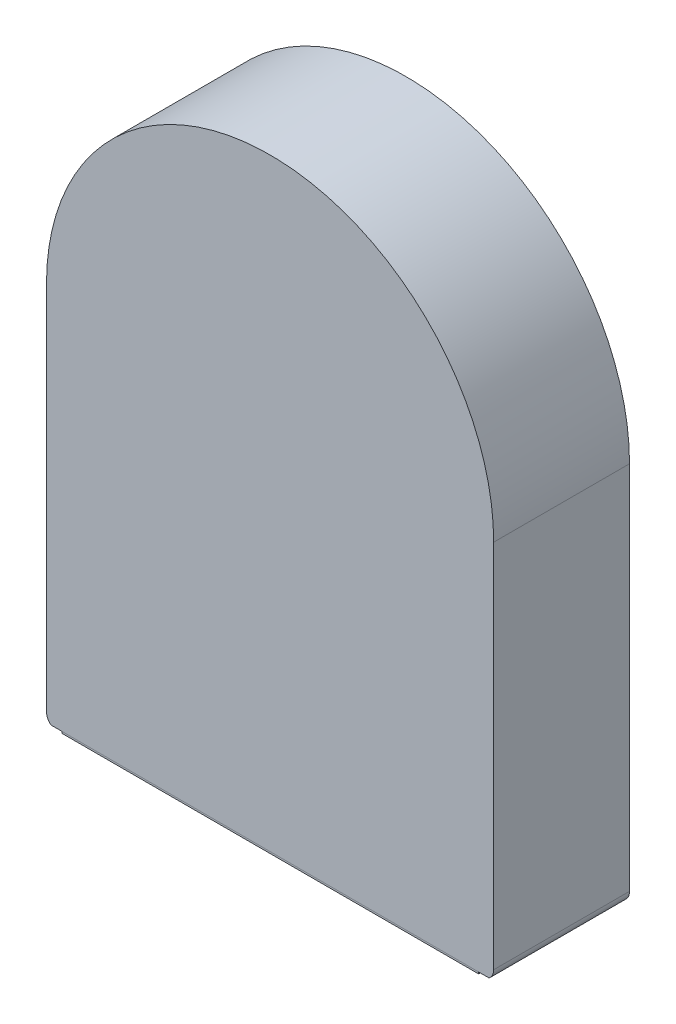
ISO-10303-21;
HEADER;
FILE_DESCRIPTION(('STEP AP214'),'2;1');
FILE_NAME('part.step','',(''),(''),'','','');
FILE_SCHEMA(('AUTOMOTIVE_DESIGN { 1 0 10303 214 1 1 1 1 }'));
ENDSEC;
DATA;
#1=APPLICATION_CONTEXT('core data for automotive mechanical design processes');
#2=APPLICATION_PROTOCOL_DEFINITION('international standard','automotive_design',2000,#1);
#3=PRODUCT_CONTEXT('',#1,'mechanical');
#4=PRODUCT('Part','Part','',(#3));
#5=PRODUCT_RELATED_PRODUCT_CATEGORY('part','',(#4));
#6=PRODUCT_DEFINITION_FORMATION('','',#4);
#7=PRODUCT_DEFINITION_CONTEXT('part definition',#1,'design');
#8=PRODUCT_DEFINITION('design','',#6,#7);
#9=PRODUCT_DEFINITION_SHAPE('','',#8);
#10=(LENGTH_UNIT() NAMED_UNIT(*) SI_UNIT(.MILLI.,.METRE.));
#11=(NAMED_UNIT(*) PLANE_ANGLE_UNIT() SI_UNIT($,.RADIAN.));
#12=(NAMED_UNIT(*) SI_UNIT($,.STERADIAN.) SOLID_ANGLE_UNIT());
#13=UNCERTAINTY_MEASURE_WITH_UNIT(LENGTH_MEASURE(1.E-05),#10,'distance_accuracy_value','');
#14=(GEOMETRIC_REPRESENTATION_CONTEXT(3) GLOBAL_UNCERTAINTY_ASSIGNED_CONTEXT((#13)) GLOBAL_UNIT_ASSIGNED_CONTEXT((#10,
#11,#12)) REPRESENTATION_CONTEXT('',''));
#15=CARTESIAN_POINT('',(0.,0.,0.));
#16=DIRECTION('',(0.,0.,1.));
#17=DIRECTION('',(1.,0.,0.));
#18=AXIS2_PLACEMENT_3D('',#15,#16,#17);
#19=CARTESIAN_POINT('',(8.8,-15.4,5.65));
#20=DIRECTION('',(0.,0.,-1.));
#21=DIRECTION('',(-1.,0.,0.));
#22=AXIS2_PLACEMENT_3D('',#19,#20,#21);
#23=CYLINDRICAL_SURFACE('',#22,0.5);
#24=CARTESIAN_POINT('',(8.8,-15.4,6.03039935251033));
#25=DIRECTION('',(0.,0.713250449154018,-0.700909264300018));
#26=DIRECTION('',(0.,0.700909264300018,0.713250449154018));
#27=AXIS2_PLACEMENT_3D('',#24,#25,#26);
#28=ELLIPSE('',#27,0.713359097199747,0.5);
#29=CARTESIAN_POINT('',(9.10934525688194,-15.79281740293,5.63066545920087));
#30=VERTEX_POINT('',#29);
#31=CARTESIAN_POINT('',(8.8,-15.9,5.52159565602451));
#32=VERTEX_POINT('',#31);
#33=EDGE_CURVE('E53',#30,#32,#28,.T.);
#34=ORIENTED_EDGE('',*,*,#33,.T.);
#35=DIRECTION('',(0.,0.,-1.));
#36=VECTOR('',#35,1.);
#37=CARTESIAN_POINT('',(8.8,-15.9,5.65));
#38=LINE('',#37,#36);
#39=CARTESIAN_POINT('',(8.8,-15.9,0.));
#40=VERTEX_POINT('',#39);
#41=EDGE_CURVE('E255',#40,#32,#38,.F.);
#42=ORIENTED_EDGE('',*,*,#41,.F.);
#43=CARTESIAN_POINT('',(8.8,-15.4,0.));
#44=DIRECTION('',(0.,0.,1.));
#45=DIRECTION('',(1.,0.,0.));
#46=AXIS2_PLACEMENT_3D('',#43,#44,#45);
#47=CIRCLE('',#46,0.5);
#48=CARTESIAN_POINT('',(9.3,-15.4,0.));
#49=VERTEX_POINT('',#48);
#50=EDGE_CURVE('E259',#49,#40,#47,.F.);
#51=ORIENTED_EDGE('',*,*,#50,.F.);
#52=DIRECTION('',(0.,0.,-1.));
#53=VECTOR('',#52,1.);
#54=CARTESIAN_POINT('',(9.3,-15.4,5.65));
#55=LINE('',#54,#53);
#56=CARTESIAN_POINT('',(9.3,-15.4,5.65));
#57=VERTEX_POINT('',#56);
#58=EDGE_CURVE('E263',#57,#49,#55,.T.);
#59=ORIENTED_EDGE('',*,*,#58,.F.);
#60=CARTESIAN_POINT('',(8.8,-15.4,5.65));
#61=DIRECTION('',(0.,0.,1.));
#62=DIRECTION('',(1.,0.,0.));
#63=AXIS2_PLACEMENT_3D('',#60,#61,#62);
#64=CIRCLE('',#63,0.5);
#65=CARTESIAN_POINT('',(9.10934525688194,-15.79281740293,5.65));
#66=VERTEX_POINT('',#65);
#67=EDGE_CURVE('E250',#66,#57,#64,.T.);
#68=ORIENTED_EDGE('',*,*,#67,.F.);
#69=DIRECTION('',(0.,0.,-1.));
#70=VECTOR('',#69,1.);
#71=CARTESIAN_POINT('',(9.10934525730095,-15.7928174026,5.65));
#72=LINE('',#71,#70);
#73=EDGE_CURVE('E46',#30,#66,#72,.F.);
#74=ORIENTED_EDGE('',*,*,#73,.F.);
#75=EDGE_LOOP('',(#34,#42,#51,#59,#68,#74));
#76=FACE_BOUND('',#75,.T.);
#77=ADVANCED_FACE('F36',(#76),#23,.T.);
#78=CARTESIAN_POINT('',(-8.8,-15.4,5.65));
#79=DIRECTION('',(0.,0.,-1.));
#80=DIRECTION('',(-1.,0.,0.));
#81=AXIS2_PLACEMENT_3D('',#78,#79,#80);
#82=CYLINDRICAL_SURFACE('',#81,0.5);
#83=CARTESIAN_POINT('',(-8.8,-15.4,5.65));
#84=DIRECTION('',(0.,0.,1.));
#85=DIRECTION('',(1.,0.,0.));
#86=AXIS2_PLACEMENT_3D('',#83,#84,#85);
#87=CIRCLE('',#86,0.5);
#88=CARTESIAN_POINT('',(-9.3,-15.4,5.65));
#89=VERTEX_POINT('',#88);
#90=CARTESIAN_POINT('',(-9.10934525730095,-15.7928174026,5.65));
#91=VERTEX_POINT('',#90);
#92=EDGE_CURVE('E252',#89,#91,#87,.T.);
#93=ORIENTED_EDGE('',*,*,#92,.F.);
#94=DIRECTION('',(0.,0.,-1.));
#95=VECTOR('',#94,1.);
#96=CARTESIAN_POINT('',(-9.3,-15.4,5.65));
#97=LINE('',#96,#95);
#98=CARTESIAN_POINT('',(-9.3,-15.4,0.));
#99=VERTEX_POINT('',#98);
#100=EDGE_CURVE('E248',#99,#89,#97,.F.);
#101=ORIENTED_EDGE('',*,*,#100,.F.);
#102=CARTESIAN_POINT('',(-8.8,-15.4,0.));
#103=DIRECTION('',(0.,0.,1.));
#104=DIRECTION('',(1.,0.,0.));
#105=AXIS2_PLACEMENT_3D('',#102,#103,#104);
#106=CIRCLE('',#105,0.5);
#107=CARTESIAN_POINT('',(-8.8,-15.9,0.));
#108=VERTEX_POINT('',#107);
#109=EDGE_CURVE('E261',#108,#99,#106,.F.);
#110=ORIENTED_EDGE('',*,*,#109,.F.);
#111=DIRECTION('',(0.,0.,-1.));
#112=VECTOR('',#111,1.);
#113=CARTESIAN_POINT('',(-8.8,-15.9,5.65));
#114=LINE('',#113,#112);
#115=CARTESIAN_POINT('',(-8.8,-15.9,5.52159565602451));
#116=VERTEX_POINT('',#115);
#117=EDGE_CURVE('E257',#116,#108,#114,.T.);
#118=ORIENTED_EDGE('',*,*,#117,.F.);
#119=CARTESIAN_POINT('',(-8.8,-15.4,6.03039935251033));
#120=DIRECTION('',(0.,0.713250449154018,-0.700909264300018));
#121=DIRECTION('',(0.,0.700909264300018,0.713250449154018));
#122=AXIS2_PLACEMENT_3D('',#119,#120,#121);
#123=ELLIPSE('',#122,0.713359097199747,0.5);
#124=CARTESIAN_POINT('',(-9.10934525730095,-15.7928174026,5.63066545953665));
#125=VERTEX_POINT('',#124);
#126=EDGE_CURVE('E143',#116,#125,#123,.T.);
#127=ORIENTED_EDGE('',*,*,#126,.T.);
#128=DIRECTION('',(0.,0.,1.));
#129=VECTOR('',#128,1.);
#130=CARTESIAN_POINT('',(-9.10934525730095,-15.7928174026,5.63066545953665));
#131=LINE('',#130,#129);
#132=EDGE_CURVE('E193',#125,#91,#131,.T.);
#133=ORIENTED_EDGE('',*,*,#132,.T.);
#134=EDGE_LOOP('',(#93,#101,#110,#118,#127,#133));
#135=FACE_BOUND('',#134,.T.);
#136=ADVANCED_FACE('F38',(#135),#82,.T.);
#137=CARTESIAN_POINT('',(0.,0.,5.65));
#138=DIRECTION('',(0.,0.,-1.));
#139=DIRECTION('',(-1.,0.,0.));
#140=AXIS2_PLACEMENT_3D('',#137,#138,#139);
#141=CYLINDRICAL_SURFACE('',#140,9.3);
#142=CARTESIAN_POINT('',(0.,0.,0.));
#143=DIRECTION('',(0.,0.,1.));
#144=DIRECTION('',(1.,0.,0.));
#145=AXIS2_PLACEMENT_3D('',#142,#143,#144);
#146=CIRCLE('',#145,9.3);
#147=CARTESIAN_POINT('',(9.3,0.,0.));
#148=VERTEX_POINT('',#147);
#149=CARTESIAN_POINT('',(-9.3,0.,0.));
#150=VERTEX_POINT('',#149);
#151=EDGE_CURVE('E198',#148,#150,#146,.T.);
#152=ORIENTED_EDGE('',*,*,#151,.T.);
#153=DIRECTION('',(0.,0.,-1.));
#154=VECTOR('',#153,1.);
#155=CARTESIAN_POINT('',(-9.3,0.,5.65));
#156=LINE('',#155,#154);
#157=CARTESIAN_POINT('',(-9.3,0.,5.65));
#158=VERTEX_POINT('',#157);
#159=EDGE_CURVE('E265',#158,#150,#156,.T.);
#160=ORIENTED_EDGE('',*,*,#159,.F.);
#161=CARTESIAN_POINT('',(0.,0.,5.65));
#162=DIRECTION('',(0.,0.,1.));
#163=DIRECTION('',(1.,0.,0.));
#164=AXIS2_PLACEMENT_3D('',#161,#162,#163);
#165=CIRCLE('',#164,9.3);
#166=CARTESIAN_POINT('',(9.3,0.,5.65));
#167=VERTEX_POINT('',#166);
#168=EDGE_CURVE('E242',#167,#158,#165,.T.);
#169=ORIENTED_EDGE('',*,*,#168,.F.);
#170=DIRECTION('',(0.,0.,-1.));
#171=VECTOR('',#170,1.);
#172=CARTESIAN_POINT('',(9.3,0.,5.65));
#173=LINE('',#172,#171);
#174=EDGE_CURVE('E267',#167,#148,#173,.T.);
#175=ORIENTED_EDGE('',*,*,#174,.T.);
#176=EDGE_LOOP('',(#152,#160,#169,#175));
#177=FACE_BOUND('',#176,.T.);
#178=ADVANCED_FACE('F355',(#177),#141,.T.);
#179=CARTESIAN_POINT('',(-9.3,0.,5.65));
#180=DIRECTION('',(1.,0.,0.));
#181=DIRECTION('',(0.,1.,0.));
#182=AXIS2_PLACEMENT_3D('',#179,#180,#181);
#183=PLANE('',#182);
#184=ORIENTED_EDGE('',*,*,#159,.T.);
#185=DIRECTION('',(0.,-1.,0.));
#186=VECTOR('',#185,1.);
#187=CARTESIAN_POINT('',(-9.3,0.,0.));
#188=LINE('',#187,#186);
#189=EDGE_CURVE('E275',#150,#99,#188,.T.);
#190=ORIENTED_EDGE('',*,*,#189,.T.);
#191=ORIENTED_EDGE('',*,*,#100,.T.);
#192=DIRECTION('',(0.,-1.,0.));
#193=VECTOR('',#192,1.);
#194=CARTESIAN_POINT('',(-9.3,0.,5.65));
#195=LINE('',#194,#193);
#196=EDGE_CURVE('E239',#158,#89,#195,.T.);
#197=ORIENTED_EDGE('',*,*,#196,.F.);
#198=EDGE_LOOP('',(#184,#190,#191,#197));
#199=FACE_BOUND('',#198,.T.);
#200=ADVANCED_FACE('F356',(#199),#183,.F.);
#201=CARTESIAN_POINT('',(-9.3,-15.9,5.65));
#202=DIRECTION('',(0.,1.,0.));
#203=DIRECTION('',(0.,0.,1.));
#204=AXIS2_PLACEMENT_3D('',#201,#202,#203);
#205=PLANE('',#204);
#206=ORIENTED_EDGE('',*,*,#41,.T.);
#207=DIRECTION('',(-1.,0.,0.));
#208=VECTOR('',#207,1.);
#209=CARTESIAN_POINT('',(0.,-15.9,5.52159565602451));
#210=LINE('',#209,#208);
#211=EDGE_CURVE('E335',#32,#116,#210,.T.);
#212=ORIENTED_EDGE('',*,*,#211,.T.);
#213=ORIENTED_EDGE('',*,*,#117,.T.);
#214=DIRECTION('',(1.,0.,0.));
#215=VECTOR('',#214,1.);
#216=CARTESIAN_POINT('',(-9.3,-15.9,0.));
#217=LINE('',#216,#215);
#218=EDGE_CURVE('E272',#108,#40,#217,.T.);
#219=ORIENTED_EDGE('',*,*,#218,.T.);
#220=EDGE_LOOP('',(#206,#212,#213,#219));
#221=FACE_BOUND('',#220,.T.);
#222=ADVANCED_FACE('F341',(#221),#205,.F.);
#223=CARTESIAN_POINT('',(9.3,0.,5.65));
#224=DIRECTION('',(-1.,0.,0.));
#225=DIRECTION('',(0.,-1.,0.));
#226=AXIS2_PLACEMENT_3D('',#223,#224,#225);
#227=PLANE('',#226);
#228=ORIENTED_EDGE('',*,*,#58,.T.);
#229=DIRECTION('',(0.,1.,0.));
#230=VECTOR('',#229,1.);
#231=CARTESIAN_POINT('',(9.3,0.,0.));
#232=LINE('',#231,#230);
#233=EDGE_CURVE('E245',#49,#148,#232,.T.);
#234=ORIENTED_EDGE('',*,*,#233,.T.);
#235=ORIENTED_EDGE('',*,*,#174,.F.);
#236=DIRECTION('',(0.,1.,0.));
#237=VECTOR('',#236,1.);
#238=CARTESIAN_POINT('',(9.3,0.,5.65));
#239=LINE('',#238,#237);
#240=EDGE_CURVE('E269',#57,#167,#239,.T.);
#241=ORIENTED_EDGE('',*,*,#240,.F.);
#242=EDGE_LOOP('',(#228,#234,#235,#241));
#243=FACE_BOUND('',#242,.T.);
#244=ADVANCED_FACE('F352',(#243),#227,.F.);
#245=CARTESIAN_POINT('',(0.,0.,5.65));
#246=DIRECTION('',(0.,0.,1.));
#247=DIRECTION('',(1.,0.,0.));
#248=AXIS2_PLACEMENT_3D('',#245,#246,#247);
#249=PLANE('',#248);
#250=DIRECTION('',(1.,0.,0.));
#251=VECTOR('',#250,1.);
#252=CARTESIAN_POINT('',(-5.00000000075,-15.7926514013,5.64999710245));
#253=LINE('',#252,#251);
#254=CARTESIAN_POINT('',(-6.97971042440521,-15.7927344019421,5.64999855122482));
#255=VERTEX_POINT('',#254);
#256=CARTESIAN_POINT('',(2.97381740255382,-15.7926513759911,5.64999855122139));
#257=VERTEX_POINT('',#256);
#258=EDGE_CURVE('E174',#255,#257,#253,.T.);
#259=ORIENTED_EDGE('',*,*,#258,.T.);
#260=DIRECTION('',(0.999999999999744,1.24820653344968E-08,7.15097058320817E-07));
#261=VECTOR('',#260,1.);
#262=CARTESIAN_POINT('',(4.99999999925,-15.792651376,5.64999855136));
#263=LINE('',#262,#261);
#264=CARTESIAN_POINT('',(6.97971041935568,-15.7927343769389,5.64999998352249));
#265=VERTEX_POINT('',#264);
#266=EDGE_CURVE('E177',#257,#265,#263,.T.);
#267=ORIENTED_EDGE('',*,*,#266,.T.);
#268=DIRECTION('',(-1.,0.,0.));
#269=VECTOR('',#268,1.);
#270=CARTESIAN_POINT('',(0.,-15.7928174026,5.65));
#271=LINE('',#270,#269);
#272=EDGE_CURVE('E196',#66,#265,#271,.T.);
#273=ORIENTED_EDGE('',*,*,#272,.F.);
#274=ORIENTED_EDGE('',*,*,#67,.T.);
#275=ORIENTED_EDGE('',*,*,#240,.T.);
#276=ORIENTED_EDGE('',*,*,#168,.T.);
#277=ORIENTED_EDGE('',*,*,#196,.T.);
#278=ORIENTED_EDGE('',*,*,#92,.T.);
#279=DIRECTION('',(-1.,0.,0.));
#280=VECTOR('',#279,1.);
#281=CARTESIAN_POINT('',(0.,-15.7928174026,5.65));
#282=LINE('',#281,#280);
#283=EDGE_CURVE('E11',#255,#91,#282,.T.);
#284=ORIENTED_EDGE('',*,*,#283,.F.);
#285=EDGE_LOOP('',(#259,#267,#273,#274,#275,#276,#277,#278,#284));
#286=FACE_BOUND('',#285,.T.);
#287=ADVANCED_FACE('F285',(#286),#249,.T.);
#288=CARTESIAN_POINT('',(0.,0.,0.));
#289=DIRECTION('',(0.,0.,1.));
#290=DIRECTION('',(1.,0.,0.));
#291=AXIS2_PLACEMENT_3D('',#288,#289,#290);
#292=PLANE('',#291);
#293=ORIENTED_EDGE('',*,*,#233,.F.);
#294=ORIENTED_EDGE('',*,*,#50,.T.);
#295=ORIENTED_EDGE('',*,*,#218,.F.);
#296=ORIENTED_EDGE('',*,*,#109,.T.);
#297=ORIENTED_EDGE('',*,*,#189,.F.);
#298=ORIENTED_EDGE('',*,*,#151,.F.);
#299=EDGE_LOOP('',(#293,#294,#295,#296,#297,#298));
#300=FACE_BOUND('',#299,.T.);
#301=ADVANCED_FACE('F218',(#300),#292,.F.);
#302=CARTESIAN_POINT('',(-10.,-15.7928174026,7.15));
#303=DIRECTION('',(0.,1.,0.));
#304=DIRECTION('',(0.,0.,1.));
#305=AXIS2_PLACEMENT_3D('',#302,#303,#304);
#306=PLANE('',#305);
#307=ORIENTED_EDGE('',*,*,#272,.T.);
#308=CARTESIAN_POINT('',(6.97975192830906,-15.7928174026,5.64048689252252));
#309=DIRECTION('',(-0.00436264473487639,0.0174522403538263,0.999838180225955));
#310=VECTOR('',#309,1.);
#311=LINE('',#308,#310);
#312=CARTESIAN_POINT('',(6.97975192830905,-15.7928174026,5.64048689252252));
#313=VERTEX_POINT('',#312);
#314=EDGE_CURVE('E185',#313,#265,#311,.T.);
#315=ORIENTED_EDGE('',*,*,#314,.F.);
#316=DIRECTION('',(1.,0.,0.));
#317=VECTOR('',#316,1.);
#318=CARTESIAN_POINT('',(-8.66700053469144,-15.7928174026,5.64048689252252));
#319=LINE('',#318,#317);
#320=CARTESIAN_POINT('',(8.66820089689577,-15.7928174026,5.64048689252252));
#321=VERTEX_POINT('',#320);
#322=EDGE_CURVE('E158',#313,#321,#319,.T.);
#323=ORIENTED_EDGE('',*,*,#322,.T.);
#324=DIRECTION('',(0.,0.,-1.));
#325=VECTOR('',#324,1.);
#326=CARTESIAN_POINT('',(8.66820089689577,-15.7928174026,0.999999999999998));
#327=LINE('',#326,#325);
#328=CARTESIAN_POINT('',(8.66821322781486,-15.7928174036935,5.63066545842397));
#329=VERTEX_POINT('',#328);
#330=EDGE_CURVE('E150',#321,#329,#327,.T.);
#331=ORIENTED_EDGE('',*,*,#330,.T.);
#332=DIRECTION('',(-1.,-1.73074002985439E-09,-1.7612138496918E-09));
#333=VECTOR('',#332,1.);
#334=CARTESIAN_POINT('',(-4.9999999983754,-15.7928174273496,5.6306654343513));
#335=LINE('',#334,#333);
#336=EDGE_CURVE('E134',#30,#329,#335,.T.);
#337=ORIENTED_EDGE('',*,*,#336,.F.);
#338=ORIENTED_EDGE('',*,*,#73,.T.);
#339=EDGE_LOOP('',(#307,#315,#323,#331,#337,#338));
#340=FACE_BOUND('',#339,.T.);
#341=ADVANCED_FACE('F155',(#340),#306,.F.);
#342=CARTESIAN_POINT('',(8.27396970801,-15.8738174032,0.999999999999998));
#343=DIRECTION('',(0.,-1.,0.));
#344=DIRECTION('',(0.,0.,-1.));
#345=AXIS2_PLACEMENT_3D('',#342,#343,#344);
#346=PLANE('',#345);
#347=DIRECTION('',(1.,0.,0.));
#348=VECTOR('',#347,1.);
#349=CARTESIAN_POINT('',(8.27396970801,-15.8738174032,5.54823926009538));
#350=LINE('',#349,#348);
#351=CARTESIAN_POINT('',(-8.66700053469144,-15.8738174032,5.54823926009538));
#352=VERTEX_POINT('',#351);
#353=CARTESIAN_POINT('',(8.66820089689577,-15.8738174032,5.54823926009538));
#354=VERTEX_POINT('',#353);
#355=EDGE_CURVE('E153',#352,#354,#350,.T.);
#356=ORIENTED_EDGE('',*,*,#355,.T.);
#357=DIRECTION('',(0.,0.,-1.));
#358=VECTOR('',#357,1.);
#359=CARTESIAN_POINT('',(8.66820089689577,-15.8738174032,0.999999999999998));
#360=LINE('',#359,#358);
#361=CARTESIAN_POINT('',(8.66820089689577,-15.8738174032,5.64048689252252));
#362=VERTEX_POINT('',#361);
#363=EDGE_CURVE('E151',#362,#354,#360,.T.);
#364=ORIENTED_EDGE('',*,*,#363,.F.);
#365=DIRECTION('',(1.,0.,0.));
#366=VECTOR('',#365,1.);
#367=CARTESIAN_POINT('',(-8.66700053469144,-15.8738174032,5.64048689252252));
#368=LINE('',#367,#366);
#369=CARTESIAN_POINT('',(-8.66700053469144,-15.8738174032,5.64048689252252));
#370=VERTEX_POINT('',#369);
#371=EDGE_CURVE('E160',#370,#362,#368,.T.);
#372=ORIENTED_EDGE('',*,*,#371,.F.);
#373=DIRECTION('',(0.,0.,1.));
#374=VECTOR('',#373,1.);
#375=CARTESIAN_POINT('',(-8.66700053469144,-15.8738174032,0.999999999999998));
#376=LINE('',#375,#374);
#377=EDGE_CURVE('E319',#352,#370,#376,.T.);
#378=ORIENTED_EDGE('',*,*,#377,.F.);
#379=EDGE_LOOP('',(#356,#364,#372,#378));
#380=FACE_BOUND('',#379,.T.);
#381=ADVANCED_FACE('F217',(#380),#346,.T.);
#382=ORIENTED_EDGE('',*,*,#283,.T.);
#383=ORIENTED_EDGE('',*,*,#132,.F.);
#384=DIRECTION('',(-1.,0.,0.));
#385=VECTOR('',#384,1.);
#386=CARTESIAN_POINT('',(-10.,-15.7928174026,5.63066545953665));
#387=LINE('',#386,#385);
#388=CARTESIAN_POINT('',(-8.66700053469144,-15.7928174026,5.63066545953665));
#389=VERTEX_POINT('',#388);
#390=EDGE_CURVE('E295',#389,#125,#387,.T.);
#391=ORIENTED_EDGE('',*,*,#390,.F.);
#392=DIRECTION('',(0.,0.,1.));
#393=VECTOR('',#392,1.);
#394=CARTESIAN_POINT('',(-8.66700053469144,-15.7928174026,0.999999999999998));
#395=LINE('',#394,#393);
#396=CARTESIAN_POINT('',(-8.66700053469144,-15.7928174026,5.64048689252252));
#397=VERTEX_POINT('',#396);
#398=EDGE_CURVE('E152',#389,#397,#395,.T.);
#399=ORIENTED_EDGE('',*,*,#398,.T.);
#400=CARTESIAN_POINT('',(-6.97975192710905,-15.7928174026,5.64048689252252));
#401=VERTEX_POINT('',#400);
#402=EDGE_CURVE('E161',#397,#401,#319,.T.);
#403=ORIENTED_EDGE('',*,*,#402,.T.);
#404=CARTESIAN_POINT('',(-6.97971043072667,-15.7926514012683,5.64999710244945));
#405=DIRECTION('',(-0.00436264475399805,-0.0174522403537114,-0.999838180225874));
#406=VECTOR('',#405,1.);
#407=LINE('',#404,#406);
#408=EDGE_CURVE('E201',#255,#401,#407,.T.);
#409=ORIENTED_EDGE('',*,*,#408,.F.);
#410=EDGE_LOOP('',(#382,#383,#391,#399,#403,#409));
#411=FACE_BOUND('',#410,.T.);
#412=ADVANCED_FACE('F219',(#411),#306,.F.);
#413=CARTESIAN_POINT('',(8.66820089689577,-33.8193830747908,0.999999999999998));
#414=DIRECTION('',(1.,0.,0.));
#415=DIRECTION('',(0.,0.,-1.));
#416=AXIS2_PLACEMENT_3D('',#413,#414,#415);
#417=PLANE('',#416);
#418=DIRECTION('',(0.,0.700909264300018,0.713250449154018));
#419=VECTOR('',#418,1.);
#420=CARTESIAN_POINT('',(8.66820089689578,-26.9637768566889,-5.73698546753076));
#421=LINE('',#420,#419);
#422=EDGE_CURVE('E138',#354,#329,#421,.T.);
#423=ORIENTED_EDGE('',*,*,#422,.T.);
#424=ORIENTED_EDGE('',*,*,#330,.F.);
#425=DIRECTION('',(0.,1.,0.));
#426=VECTOR('',#425,1.);
#427=CARTESIAN_POINT('',(8.66820089689577,-33.8193830747908,5.64048689252252));
#428=LINE('',#427,#426);
#429=EDGE_CURVE('E164',#362,#321,#428,.T.);
#430=ORIENTED_EDGE('',*,*,#429,.F.);
#431=ORIENTED_EDGE('',*,*,#363,.T.);
#432=EDGE_LOOP('',(#423,#424,#430,#431));
#433=FACE_BOUND('',#432,.T.);
#434=ADVANCED_FACE('F148',(#433),#417,.T.);
#435=CARTESIAN_POINT('',(-8.66700053469144,-33.8193830747908,0.999999999999998));
#436=DIRECTION('',(-1.,0.,0.));
#437=DIRECTION('',(0.,0.,1.));
#438=AXIS2_PLACEMENT_3D('',#435,#436,#437);
#439=PLANE('',#438);
#440=DIRECTION('',(0.,-0.700909264300018,-0.713250449154018));
#441=VECTOR('',#440,1.);
#442=CARTESIAN_POINT('',(-8.66700053469144,-26.9637768566889,-5.73698546753076));
#443=LINE('',#442,#441);
#444=EDGE_CURVE('E144',#389,#352,#443,.T.);
#445=ORIENTED_EDGE('',*,*,#444,.T.);
#446=ORIENTED_EDGE('',*,*,#377,.T.);
#447=DIRECTION('',(0.,1.,0.));
#448=VECTOR('',#447,1.);
#449=CARTESIAN_POINT('',(-8.66700053469144,-33.8193830747908,5.64048689252252));
#450=LINE('',#449,#448);
#451=EDGE_CURVE('E321',#370,#397,#450,.T.);
#452=ORIENTED_EDGE('',*,*,#451,.T.);
#453=ORIENTED_EDGE('',*,*,#398,.F.);
#454=EDGE_LOOP('',(#445,#446,#452,#453));
#455=FACE_BOUND('',#454,.T.);
#456=ADVANCED_FACE('F441',(#455),#439,.T.);
#457=CARTESIAN_POINT('',(9.3,-15.9,-0.500000000000002));
#458=DIRECTION('',(0.,-0.999847695156391,0.0174524064373068));
#459=DIRECTION('',(-1.,0.,0.));
#460=AXIS2_PLACEMENT_3D('',#457,#458,#459);
#461=PLANE('',#460);
#462=ORIENTED_EDGE('',*,*,#314,.T.);
#463=ORIENTED_EDGE('',*,*,#266,.F.);
#464=ORIENTED_EDGE('',*,*,#258,.F.);
#465=ORIENTED_EDGE('',*,*,#408,.T.);
#466=DIRECTION('',(-1.,0.,0.));
#467=VECTOR('',#466,1.);
#468=CARTESIAN_POINT('',(9.3,-15.7928174026,5.64048689252304));
#469=LINE('',#468,#467);
#470=EDGE_CURVE('E178',#313,#401,#469,.T.);
#471=ORIENTED_EDGE('',*,*,#470,.F.);
#472=EDGE_LOOP('',(#462,#463,#464,#465,#471));
#473=FACE_BOUND('',#472,.T.);
#474=ADVANCED_FACE('F222',(#473),#461,.T.);
#475=CARTESIAN_POINT('',(-8.66700053469144,-33.8193830747908,5.64048689252252));
#476=DIRECTION('',(0.,0.,1.));
#477=DIRECTION('',(1.,0.,0.));
#478=AXIS2_PLACEMENT_3D('',#475,#476,#477);
#479=PLANE('',#478);
#480=ORIENTED_EDGE('',*,*,#451,.F.);
#481=ORIENTED_EDGE('',*,*,#371,.T.);
#482=ORIENTED_EDGE('',*,*,#429,.T.);
#483=ORIENTED_EDGE('',*,*,#322,.F.);
#484=ORIENTED_EDGE('',*,*,#470,.T.);
#485=ORIENTED_EDGE('',*,*,#402,.F.);
#486=EDGE_LOOP('',(#480,#481,#482,#483,#484,#485));
#487=FACE_BOUND('',#486,.T.);
#488=ADVANCED_FACE('F220',(#487),#479,.T.);
#489=CARTESIAN_POINT('',(-5.,-15.3316709855,6.09993146282));
#490=DIRECTION('',(0.,0.713250449154018,-0.700909264300018));
#491=DIRECTION('',(-1.,0.,0.));
#492=AXIS2_PLACEMENT_3D('',#489,#490,#491);
#493=PLANE('',#492);
#494=ORIENTED_EDGE('',*,*,#336,.T.);
#495=ORIENTED_EDGE('',*,*,#422,.F.);
#496=ORIENTED_EDGE('',*,*,#355,.F.);
#497=ORIENTED_EDGE('',*,*,#444,.F.);
#498=ORIENTED_EDGE('',*,*,#390,.T.);
#499=ORIENTED_EDGE('',*,*,#126,.F.);
#500=ORIENTED_EDGE('',*,*,#211,.F.);
#501=ORIENTED_EDGE('',*,*,#33,.F.);
#502=EDGE_LOOP('',(#494,#495,#496,#497,#498,#499,#500,#501));
#503=FACE_BOUND('',#502,.T.);
#504=ADVANCED_FACE('F136',(#503),#493,.F.);
#505=CLOSED_SHELL('',(#77,#136,#178,#200,#222,#244,#287,#301,#341,#381,#412,#434,#456,#474,#488,#504));
#506=MANIFOLD_SOLID_BREP('B2',#505);
#507=ADVANCED_BREP_SHAPE_REPRESENTATION('',(#18,#506),#14);
#508=SHAPE_DEFINITION_REPRESENTATION(#9,#507);
ENDSEC;
END-ISO-10303-21;
